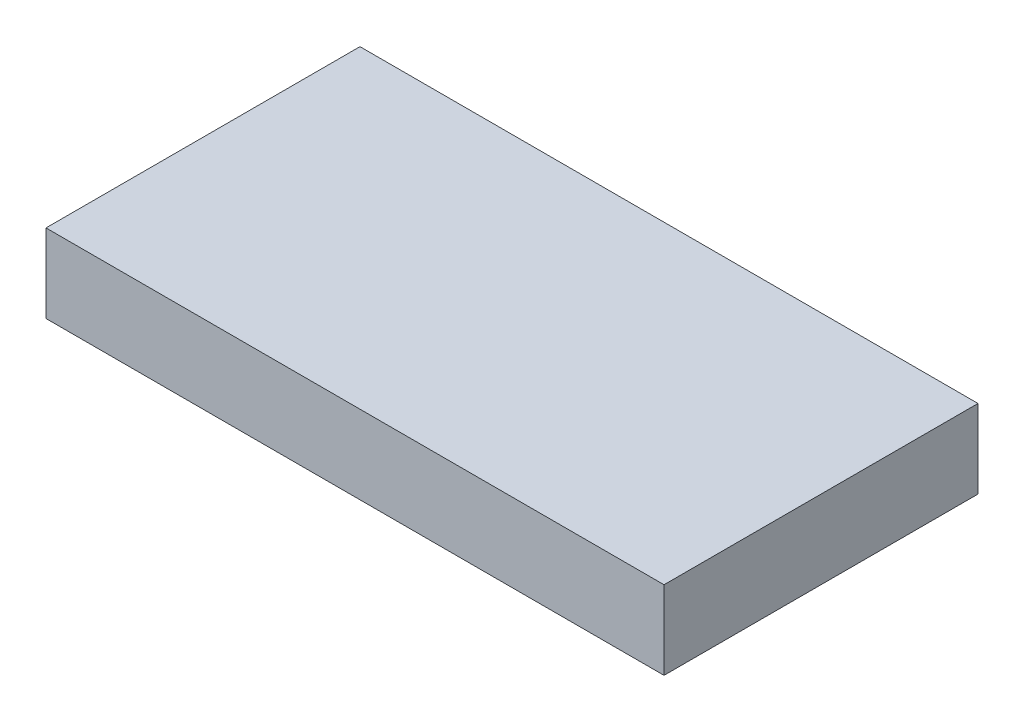
ISO-10303-21;
HEADER;
FILE_DESCRIPTION(('STEP AP214'),'2;1');
FILE_NAME('part.step','',(''),(''),'','','');
FILE_SCHEMA(('AUTOMOTIVE_DESIGN { 1 0 10303 214 1 1 1 1 }'));
ENDSEC;
DATA;
#1=APPLICATION_CONTEXT('core data for automotive mechanical design processes');
#2=APPLICATION_PROTOCOL_DEFINITION('international standard','automotive_design',2000,#1);
#3=PRODUCT_CONTEXT('',#1,'mechanical');
#4=PRODUCT('Part','Part','',(#3));
#5=PRODUCT_RELATED_PRODUCT_CATEGORY('part','',(#4));
#6=PRODUCT_DEFINITION_FORMATION('','',#4);
#7=PRODUCT_DEFINITION_CONTEXT('part definition',#1,'design');
#8=PRODUCT_DEFINITION('design','',#6,#7);
#9=PRODUCT_DEFINITION_SHAPE('','',#8);
#10=(LENGTH_UNIT() NAMED_UNIT(*) SI_UNIT(.MILLI.,.METRE.));
#11=(NAMED_UNIT(*) PLANE_ANGLE_UNIT() SI_UNIT($,.RADIAN.));
#12=(NAMED_UNIT(*) SI_UNIT($,.STERADIAN.) SOLID_ANGLE_UNIT());
#13=UNCERTAINTY_MEASURE_WITH_UNIT(LENGTH_MEASURE(1.E-05),#10,'distance_accuracy_value','');
#14=(GEOMETRIC_REPRESENTATION_CONTEXT(3) GLOBAL_UNCERTAINTY_ASSIGNED_CONTEXT((#13)) GLOBAL_UNIT_ASSIGNED_CONTEXT((#10,
#11,#12)) REPRESENTATION_CONTEXT('',''));
#15=CARTESIAN_POINT('',(0.,0.,0.));
#16=DIRECTION('',(0.,0.,1.));
#17=DIRECTION('',(1.,0.,0.));
#18=AXIS2_PLACEMENT_3D('',#15,#16,#17);
#19=CARTESIAN_POINT('',(0.,25.4,0.));
#20=DIRECTION('',(1.,0.,0.));
#21=DIRECTION('',(0.,0.,-1.));
#22=AXIS2_PLACEMENT_3D('',#19,#20,#21);
#23=PLANE('',#22);
#24=DIRECTION('',(0.,0.,1.));
#25=VECTOR('',#24,1.);
#26=CARTESIAN_POINT('',(0.,0.,0.));
#27=LINE('',#26,#25);
#28=CARTESIAN_POINT('',(0.,0.,-101.6));
#29=VERTEX_POINT('',#28);
#30=CARTESIAN_POINT('',(0.,0.,0.));
#31=VERTEX_POINT('',#30);
#32=EDGE_CURVE('E94',#29,#31,#27,.T.);
#33=ORIENTED_EDGE('',*,*,#32,.T.);
#34=DIRECTION('',(0.,-1.,0.));
#35=VECTOR('',#34,1.);
#36=CARTESIAN_POINT('',(0.,25.4,0.));
#37=LINE('',#36,#35);
#38=CARTESIAN_POINT('',(0.,25.4,0.));
#39=VERTEX_POINT('',#38);
#40=EDGE_CURVE('E11',#39,#31,#37,.T.);
#41=ORIENTED_EDGE('',*,*,#40,.F.);
#42=DIRECTION('',(0.,0.,1.));
#43=VECTOR('',#42,1.);
#44=CARTESIAN_POINT('',(0.,25.4,0.));
#45=LINE('',#44,#43);
#46=CARTESIAN_POINT('',(0.,25.4,-101.6));
#47=VERTEX_POINT('',#46);
#48=EDGE_CURVE('E82',#47,#39,#45,.T.);
#49=ORIENTED_EDGE('',*,*,#48,.F.);
#50=DIRECTION('',(0.,-1.,0.));
#51=VECTOR('',#50,1.);
#52=CARTESIAN_POINT('',(0.,25.4,-101.6));
#53=LINE('',#52,#51);
#54=EDGE_CURVE('E90',#47,#29,#53,.T.);
#55=ORIENTED_EDGE('',*,*,#54,.T.);
#56=EDGE_LOOP('',(#33,#41,#49,#55));
#57=FACE_BOUND('',#56,.T.);
#58=ADVANCED_FACE('F31',(#57),#23,.F.);
#59=CARTESIAN_POINT('',(0.,25.4,0.));
#60=DIRECTION('',(0.,0.,-1.));
#61=DIRECTION('',(-1.,0.,0.));
#62=AXIS2_PLACEMENT_3D('',#59,#60,#61);
#63=PLANE('',#62);
#64=DIRECTION('',(1.,0.,0.));
#65=VECTOR('',#64,1.);
#66=CARTESIAN_POINT('',(0.,0.,0.));
#67=LINE('',#66,#65);
#68=CARTESIAN_POINT('',(200.,0.,0.));
#69=VERTEX_POINT('',#68);
#70=EDGE_CURVE('E86',#31,#69,#67,.T.);
#71=ORIENTED_EDGE('',*,*,#70,.T.);
#72=DIRECTION('',(0.,-1.,0.));
#73=VECTOR('',#72,1.);
#74=CARTESIAN_POINT('',(200.,25.4,0.));
#75=LINE('',#74,#73);
#76=CARTESIAN_POINT('',(200.,25.4,0.));
#77=VERTEX_POINT('',#76);
#78=EDGE_CURVE('E39',#77,#69,#75,.T.);
#79=ORIENTED_EDGE('',*,*,#78,.F.);
#80=DIRECTION('',(1.,0.,0.));
#81=VECTOR('',#80,1.);
#82=CARTESIAN_POINT('',(0.,25.4,0.));
#83=LINE('',#82,#81);
#84=EDGE_CURVE('E77',#39,#77,#83,.T.);
#85=ORIENTED_EDGE('',*,*,#84,.F.);
#86=ORIENTED_EDGE('',*,*,#40,.T.);
#87=EDGE_LOOP('',(#71,#79,#85,#86));
#88=FACE_BOUND('',#87,.T.);
#89=ADVANCED_FACE('F85',(#88),#63,.F.);
#90=CARTESIAN_POINT('',(200.,25.4,0.));
#91=DIRECTION('',(-1.,0.,0.));
#92=DIRECTION('',(0.,0.,1.));
#93=AXIS2_PLACEMENT_3D('',#90,#91,#92);
#94=PLANE('',#93);
#95=DIRECTION('',(0.,0.,-1.));
#96=VECTOR('',#95,1.);
#97=CARTESIAN_POINT('',(200.,0.,0.));
#98=LINE('',#97,#96);
#99=CARTESIAN_POINT('',(200.,0.,-101.6));
#100=VERTEX_POINT('',#99);
#101=EDGE_CURVE('E64',#69,#100,#98,.T.);
#102=ORIENTED_EDGE('',*,*,#101,.T.);
#103=DIRECTION('',(0.,-1.,0.));
#104=VECTOR('',#103,1.);
#105=CARTESIAN_POINT('',(200.,25.4,-101.6));
#106=LINE('',#105,#104);
#107=CARTESIAN_POINT('',(200.,25.4,-101.6));
#108=VERTEX_POINT('',#107);
#109=EDGE_CURVE('E87',#108,#100,#106,.T.);
#110=ORIENTED_EDGE('',*,*,#109,.F.);
#111=DIRECTION('',(0.,0.,-1.));
#112=VECTOR('',#111,1.);
#113=CARTESIAN_POINT('',(200.,25.4,0.));
#114=LINE('',#113,#112);
#115=EDGE_CURVE('E80',#77,#108,#114,.T.);
#116=ORIENTED_EDGE('',*,*,#115,.F.);
#117=ORIENTED_EDGE('',*,*,#78,.T.);
#118=EDGE_LOOP('',(#102,#110,#116,#117));
#119=FACE_BOUND('',#118,.T.);
#120=ADVANCED_FACE('F88',(#119),#94,.F.);
#121=CARTESIAN_POINT('',(0.,25.4,-101.6));
#122=DIRECTION('',(0.,0.,1.));
#123=DIRECTION('',(1.,0.,0.));
#124=AXIS2_PLACEMENT_3D('',#121,#122,#123);
#125=PLANE('',#124);
#126=DIRECTION('',(-1.,0.,0.));
#127=VECTOR('',#126,1.);
#128=CARTESIAN_POINT('',(0.,0.,-101.6));
#129=LINE('',#128,#127);
#130=EDGE_CURVE('E70',#100,#29,#129,.T.);
#131=ORIENTED_EDGE('',*,*,#130,.T.);
#132=ORIENTED_EDGE('',*,*,#54,.F.);
#133=DIRECTION('',(-1.,0.,0.));
#134=VECTOR('',#133,1.);
#135=CARTESIAN_POINT('',(0.,25.4,-101.6));
#136=LINE('',#135,#134);
#137=EDGE_CURVE('E47',#108,#47,#136,.T.);
#138=ORIENTED_EDGE('',*,*,#137,.F.);
#139=ORIENTED_EDGE('',*,*,#109,.T.);
#140=EDGE_LOOP('',(#131,#132,#138,#139));
#141=FACE_BOUND('',#140,.T.);
#142=ADVANCED_FACE('F101',(#141),#125,.F.);
#143=CARTESIAN_POINT('',(0.,25.4,-101.6));
#144=DIRECTION('',(0.,-1.,0.));
#145=DIRECTION('',(0.,0.,-1.));
#146=AXIS2_PLACEMENT_3D('',#143,#144,#145);
#147=PLANE('',#146);
#148=ORIENTED_EDGE('',*,*,#48,.T.);
#149=ORIENTED_EDGE('',*,*,#84,.T.);
#150=ORIENTED_EDGE('',*,*,#115,.T.);
#151=ORIENTED_EDGE('',*,*,#137,.T.);
#152=EDGE_LOOP('',(#148,#149,#150,#151));
#153=FACE_BOUND('',#152,.T.);
#154=ADVANCED_FACE('F78',(#153),#147,.F.);
#155=CARTESIAN_POINT('',(0.,0.,-101.6));
#156=DIRECTION('',(0.,-1.,0.));
#157=DIRECTION('',(0.,0.,-1.));
#158=AXIS2_PLACEMENT_3D('',#155,#156,#157);
#159=PLANE('',#158);
#160=ORIENTED_EDGE('',*,*,#32,.F.);
#161=ORIENTED_EDGE('',*,*,#130,.F.);
#162=ORIENTED_EDGE('',*,*,#101,.F.);
#163=ORIENTED_EDGE('',*,*,#70,.F.);
#164=EDGE_LOOP('',(#160,#161,#162,#163));
#165=FACE_BOUND('',#164,.T.);
#166=ADVANCED_FACE('F104',(#165),#159,.T.);
#167=CLOSED_SHELL('',(#58,#89,#120,#142,#154,#166));
#168=MANIFOLD_SOLID_BREP('B2',#167);
#169=ADVANCED_BREP_SHAPE_REPRESENTATION('',(#18,#168),#14);
#170=SHAPE_DEFINITION_REPRESENTATION(#9,#169);
ENDSEC;
END-ISO-10303-21;
